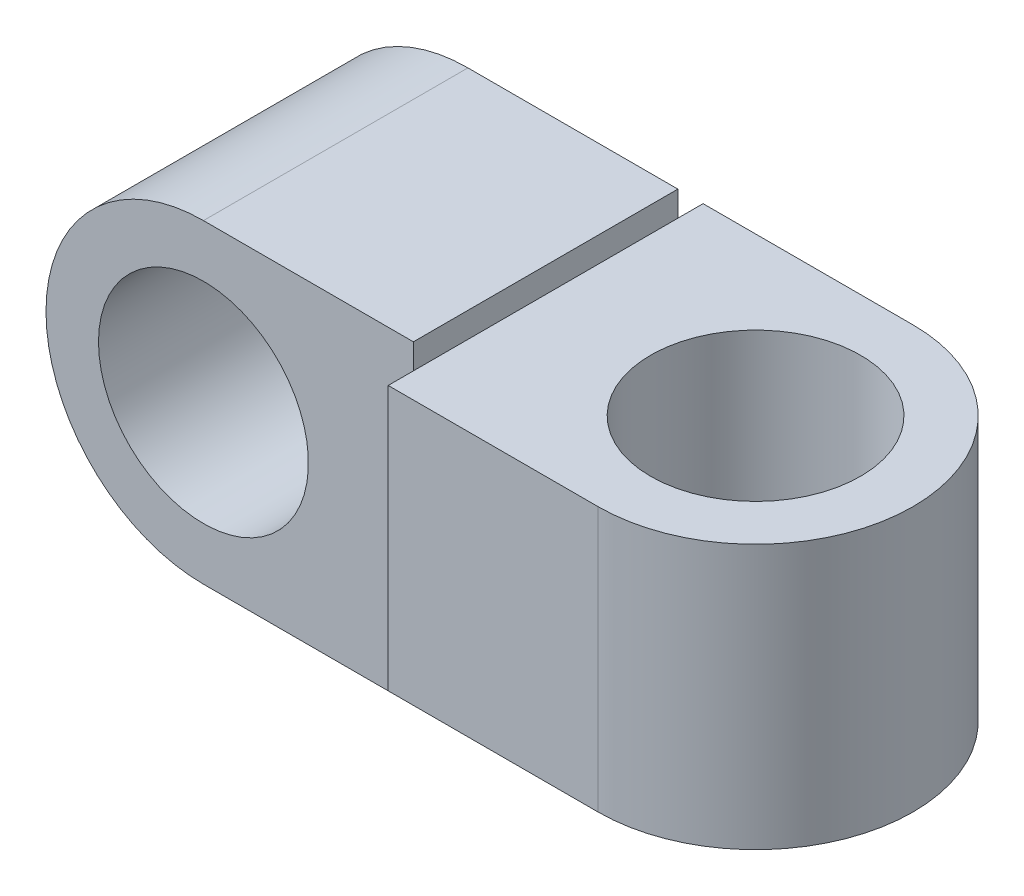
ISO-10303-21;
HEADER;
FILE_DESCRIPTION(('STEP AP214'),'2;1');
FILE_NAME('part.step','',(''),(''),'','','');
FILE_SCHEMA(('AUTOMOTIVE_DESIGN { 1 0 10303 214 1 1 1 1 }'));
ENDSEC;
DATA;
#1=APPLICATION_CONTEXT('core data for automotive mechanical design processes');
#2=APPLICATION_PROTOCOL_DEFINITION('international standard','automotive_design',2000,#1);
#3=PRODUCT_CONTEXT('',#1,'mechanical');
#4=PRODUCT('Part','Part','',(#3));
#5=PRODUCT_RELATED_PRODUCT_CATEGORY('part','',(#4));
#6=PRODUCT_DEFINITION_FORMATION('','',#4);
#7=PRODUCT_DEFINITION_CONTEXT('part definition',#1,'design');
#8=PRODUCT_DEFINITION('design','',#6,#7);
#9=PRODUCT_DEFINITION_SHAPE('','',#8);
#10=(LENGTH_UNIT() NAMED_UNIT(*) SI_UNIT(.MILLI.,.METRE.));
#11=(NAMED_UNIT(*) PLANE_ANGLE_UNIT() SI_UNIT($,.RADIAN.));
#12=(NAMED_UNIT(*) SI_UNIT($,.STERADIAN.) SOLID_ANGLE_UNIT());
#13=UNCERTAINTY_MEASURE_WITH_UNIT(LENGTH_MEASURE(1.E-05),#10,'distance_accuracy_value','');
#14=(GEOMETRIC_REPRESENTATION_CONTEXT(3) GLOBAL_UNCERTAINTY_ASSIGNED_CONTEXT((#13)) GLOBAL_UNIT_ASSIGNED_CONTEXT((#10,
#11,#12)) REPRESENTATION_CONTEXT('',''));
#15=CARTESIAN_POINT('',(0.,0.,0.));
#16=DIRECTION('',(0.,0.,1.));
#17=DIRECTION('',(1.,0.,0.));
#18=AXIS2_PLACEMENT_3D('',#15,#16,#17);
#19=CARTESIAN_POINT('',(0.,0.,9.99999999999987));
#20=DIRECTION('',(1.,0.,0.));
#21=DIRECTION('',(0.,0.,-0.999999999999996));
#22=AXIS2_PLACEMENT_3D('',#19,#20,#21);
#23=PLANE('',#22);
#24=DIRECTION('',(0.,-1.,0.));
#25=VECTOR('',#24,1.);
#26=CARTESIAN_POINT('',(0.,0.,9.99999999999987));
#27=LINE('',#26,#25);
#28=CARTESIAN_POINT('',(0.,11.90625,9.99999999999987));
#29=VERTEX_POINT('',#28);
#30=CARTESIAN_POINT('',(0.,10.,9.99999999999987));
#31=VERTEX_POINT('',#30);
#32=EDGE_CURVE('E181',#29,#31,#27,.T.);
#33=ORIENTED_EDGE('',*,*,#32,.T.);
#34=DIRECTION('',(0.,0.,-0.999999999999996));
#35=VECTOR('',#34,1.);
#36=CARTESIAN_POINT('',(0.,10.,0.));
#37=LINE('',#36,#35);
#38=CARTESIAN_POINT('',(0.,10.,-10.));
#39=VERTEX_POINT('',#38);
#40=EDGE_CURVE('E45',#31,#39,#37,.T.);
#41=ORIENTED_EDGE('',*,*,#40,.T.);
#42=DIRECTION('',(0.,-1.,0.));
#43=VECTOR('',#42,1.);
#44=CARTESIAN_POINT('',(0.,0.,-10.));
#45=LINE('',#44,#43);
#46=CARTESIAN_POINT('',(0.,11.90625,-10.));
#47=VERTEX_POINT('',#46);
#48=EDGE_CURVE('E195',#47,#39,#45,.T.);
#49=ORIENTED_EDGE('',*,*,#48,.F.);
#50=DIRECTION('',(0.,0.,-0.999999999999996));
#51=VECTOR('',#50,1.);
#52=CARTESIAN_POINT('',(0.,11.90625,9.99999999999987));
#53=LINE('',#52,#51);
#54=EDGE_CURVE('E202',#29,#47,#53,.T.);
#55=ORIENTED_EDGE('',*,*,#54,.F.);
#56=EDGE_LOOP('',(#33,#41,#49,#55));
#57=FACE_BOUND('',#56,.T.);
#58=ADVANCED_FACE('F36',(#57),#23,.T.);
#59=CARTESIAN_POINT('',(-15.875,0.,9.99999999999987));
#60=DIRECTION('',(0.,0.,-0.999999999999996));
#61=DIRECTION('',(-1.,0.,0.));
#62=AXIS2_PLACEMENT_3D('',#59,#60,#61);
#63=CYLINDRICAL_SURFACE('',#62,11.90625);
#64=CARTESIAN_POINT('',(-15.875,0.,-10.));
#65=DIRECTION('',(0.,0.,0.999999999999996));
#66=DIRECTION('',(1.,0.,0.));
#67=AXIS2_PLACEMENT_3D('',#64,#65,#66);
#68=CIRCLE('',#67,11.90625);
#69=CARTESIAN_POINT('',(-15.875,11.90625,-10.));
#70=VERTEX_POINT('',#69);
#71=CARTESIAN_POINT('',(-15.875,-11.90625,-10.));
#72=VERTEX_POINT('',#71);
#73=EDGE_CURVE('E189',#70,#72,#68,.T.);
#74=ORIENTED_EDGE('',*,*,#73,.T.);
#75=DIRECTION('',(0.,0.,-0.999999999999996));
#76=VECTOR('',#75,1.);
#77=CARTESIAN_POINT('',(-15.875,-11.90625,9.99999999999987));
#78=LINE('',#77,#76);
#79=CARTESIAN_POINT('',(-15.875,-11.90625,9.99999999999987));
#80=VERTEX_POINT('',#79);
#81=EDGE_CURVE('E40',#80,#72,#78,.T.);
#82=ORIENTED_EDGE('',*,*,#81,.F.);
#83=CARTESIAN_POINT('',(-15.875,0.,9.99999999999987));
#84=DIRECTION('',(0.,0.,0.999999999999996));
#85=DIRECTION('',(1.,0.,0.));
#86=AXIS2_PLACEMENT_3D('',#83,#84,#85);
#87=CIRCLE('',#86,11.90625);
#88=CARTESIAN_POINT('',(-15.875,11.90625,9.99999999999987));
#89=VERTEX_POINT('',#88);
#90=EDGE_CURVE('E90',#89,#80,#87,.T.);
#91=ORIENTED_EDGE('',*,*,#90,.F.);
#92=DIRECTION('',(0.,0.,-0.999999999999996));
#93=VECTOR('',#92,1.);
#94=CARTESIAN_POINT('',(-15.875,11.90625,9.99999999999987));
#95=LINE('',#94,#93);
#96=EDGE_CURVE('E64',#89,#70,#95,.T.);
#97=ORIENTED_EDGE('',*,*,#96,.T.);
#98=EDGE_LOOP('',(#74,#82,#91,#97));
#99=FACE_BOUND('',#98,.T.);
#100=ADVANCED_FACE('F227',(#99),#63,.T.);
#101=CARTESIAN_POINT('',(0.,-11.90625,9.99999999999987));
#102=DIRECTION('',(0.,-1.,0.));
#103=DIRECTION('',(0.,0.,-0.999999999999996));
#104=AXIS2_PLACEMENT_3D('',#101,#102,#103);
#105=PLANE('',#104);
#106=DIRECTION('',(-1.,0.,0.));
#107=VECTOR('',#106,1.);
#108=CARTESIAN_POINT('',(0.,-11.90625,-10.));
#109=LINE('',#108,#107);
#110=CARTESIAN_POINT('',(0.,-11.90625,-10.));
#111=VERTEX_POINT('',#110);
#112=EDGE_CURVE('E191',#111,#72,#109,.T.);
#113=ORIENTED_EDGE('',*,*,#112,.F.);
#114=DIRECTION('',(0.,0.,-0.999999999999996));
#115=VECTOR('',#114,1.);
#116=CARTESIAN_POINT('',(0.,-11.90625,9.99999999999987));
#117=LINE('',#116,#115);
#118=CARTESIAN_POINT('',(0.,-11.90625,9.99999999999987));
#119=VERTEX_POINT('',#118);
#120=EDGE_CURVE('E203',#119,#111,#117,.T.);
#121=ORIENTED_EDGE('',*,*,#120,.F.);
#122=DIRECTION('',(-1.,0.,0.));
#123=VECTOR('',#122,1.);
#124=CARTESIAN_POINT('',(0.,-11.90625,9.99999999999987));
#125=LINE('',#124,#123);
#126=EDGE_CURVE('E177',#119,#80,#125,.T.);
#127=ORIENTED_EDGE('',*,*,#126,.T.);
#128=ORIENTED_EDGE('',*,*,#81,.T.);
#129=EDGE_LOOP('',(#113,#121,#127,#128));
#130=FACE_BOUND('',#129,.T.);
#131=ADVANCED_FACE('F225',(#130),#105,.T.);
#132=DIRECTION('',(0.,0.,-0.999999999999996));
#133=VECTOR('',#132,1.);
#134=CARTESIAN_POINT('',(0.,-10.,0.));
#135=LINE('',#134,#133);
#136=CARTESIAN_POINT('',(0.,-10.,9.99999999999987));
#137=VERTEX_POINT('',#136);
#138=CARTESIAN_POINT('',(0.,-10.,-10.));
#139=VERTEX_POINT('',#138);
#140=EDGE_CURVE('E11',#137,#139,#135,.T.);
#141=ORIENTED_EDGE('',*,*,#140,.F.);
#142=EDGE_CURVE('E180',#137,#119,#27,.T.);
#143=ORIENTED_EDGE('',*,*,#142,.T.);
#144=ORIENTED_EDGE('',*,*,#120,.T.);
#145=EDGE_CURVE('E194',#139,#111,#45,.T.);
#146=ORIENTED_EDGE('',*,*,#145,.F.);
#147=EDGE_LOOP('',(#141,#143,#144,#146));
#148=FACE_BOUND('',#147,.T.);
#149=ADVANCED_FACE('F224',(#148),#23,.T.);
#150=CARTESIAN_POINT('',(-15.875,0.,9.99999999999987));
#151=DIRECTION('',(0.,0.,-0.999999999999996));
#152=DIRECTION('',(-1.,0.,0.));
#153=AXIS2_PLACEMENT_3D('',#150,#151,#152);
#154=CYLINDRICAL_SURFACE('',#153,7.9375);
#155=CARTESIAN_POINT('',(-15.875,0.,9.99999999999987));
#156=DIRECTION('',(0.,0.,0.999999999999996));
#157=DIRECTION('',(1.,0.,0.));
#158=AXIS2_PLACEMENT_3D('',#155,#156,#157);
#159=CIRCLE('',#158,7.9375);
#160=CARTESIAN_POINT('',(-23.8125,0.,9.99999999999987));
#161=VERTEX_POINT('',#160);
#162=EDGE_CURVE('E172',#161,#161,#159,.T.);
#163=CARTESIAN_POINT('',(-15.875,0.,-10.));
#164=DIRECTION('',(0.,0.,0.999999999999996));
#165=DIRECTION('',(1.,0.,0.));
#166=AXIS2_PLACEMENT_3D('',#163,#164,#165);
#167=CIRCLE('',#166,7.9375);
#168=CARTESIAN_POINT('',(-23.8125,0.,-10.));
#169=VERTEX_POINT('',#168);
#170=EDGE_CURVE('E144',#169,#169,#167,.T.);
#171=CARTESIAN_POINT('',(-23.8125,0.,9.99999999999987));
#172=CARTESIAN_POINT('',(-23.8125,0.,9.79166666666654));
#173=CARTESIAN_POINT('',(-23.8125,0.,9.5833333333332));
#174=CARTESIAN_POINT('',(-23.8125,0.,9.16666666666654));
#175=CARTESIAN_POINT('',(-23.8125,0.,8.95833333333321));
#176=CARTESIAN_POINT('',(-23.8125,0.,8.54166666666655));
#177=CARTESIAN_POINT('',(-23.8125,0.,8.33333333333321));
#178=CARTESIAN_POINT('',(-23.8125,0.,7.91666666666655));
#179=CARTESIAN_POINT('',(-23.8125,0.,7.70833333333322));
#180=CARTESIAN_POINT('',(-23.8125,0.,7.29166666666655));
#181=CARTESIAN_POINT('',(-23.8125,0.,7.08333333333322));
#182=CARTESIAN_POINT('',(-23.8125,0.,6.66666666666656));
#183=CARTESIAN_POINT('',(-23.8125,0.,6.45833333333322));
#184=CARTESIAN_POINT('',(-23.8125,0.,6.04166666666656));
#185=CARTESIAN_POINT('',(-23.8125,0.,5.83333333333323));
#186=CARTESIAN_POINT('',(-23.8125,0.,5.41666666666656));
#187=CARTESIAN_POINT('',(-23.8125,0.,5.20833333333323));
#188=CARTESIAN_POINT('',(-23.8125,0.,4.79166666666657));
#189=CARTESIAN_POINT('',(-23.8125,0.,4.58333333333323));
#190=CARTESIAN_POINT('',(-23.8125,0.,4.16666666666657));
#191=CARTESIAN_POINT('',(-23.8125,0.,3.95833333333324));
#192=CARTESIAN_POINT('',(-23.8125,0.,3.54166666666657));
#193=CARTESIAN_POINT('',(-23.8125,0.,3.33333333333324));
#194=CARTESIAN_POINT('',(-23.8125,0.,2.91666666666658));
#195=CARTESIAN_POINT('',(-23.8125,0.,2.70833333333325));
#196=CARTESIAN_POINT('',(-23.8125,0.,2.29166666666658));
#197=CARTESIAN_POINT('',(-23.8125,0.,2.08333333333325));
#198=CARTESIAN_POINT('',(-23.8125,0.,1.66666666666658));
#199=CARTESIAN_POINT('',(-23.8125,0.,1.45833333333325));
#200=CARTESIAN_POINT('',(-23.8125,0.,1.04166666666659));
#201=CARTESIAN_POINT('',(-23.8125,0.,0.833333333333256));
#202=CARTESIAN_POINT('',(-23.8125,0.,0.416666666666592));
#203=CARTESIAN_POINT('',(-23.8125,0.,0.208333333333259));
#204=CARTESIAN_POINT('',(-23.8125,0.,-0.208333333333405));
#205=CARTESIAN_POINT('',(-23.8125,0.,-0.416666666666738));
#206=CARTESIAN_POINT('',(-23.8125,0.,-0.833333333333402));
#207=CARTESIAN_POINT('',(-23.8125,0.,-1.04166666666673));
#208=CARTESIAN_POINT('',(-23.8125,0.,-1.4583333333334));
#209=CARTESIAN_POINT('',(-23.8125,0.,-1.66666666666673));
#210=CARTESIAN_POINT('',(-23.8125,0.,-2.08333333333339));
#211=CARTESIAN_POINT('',(-23.8125,0.,-2.29166666666673));
#212=CARTESIAN_POINT('',(-23.8125,0.,-2.70833333333339));
#213=CARTESIAN_POINT('',(-23.8125,0.,-2.91666666666672));
#214=CARTESIAN_POINT('',(-23.8125,0.,-3.33333333333339));
#215=CARTESIAN_POINT('',(-23.8125,0.,-3.54166666666672));
#216=CARTESIAN_POINT('',(-23.8125,0.,-3.95833333333338));
#217=CARTESIAN_POINT('',(-23.8125,0.,-4.16666666666671));
#218=CARTESIAN_POINT('',(-23.8125,0.,-4.58333333333338));
#219=CARTESIAN_POINT('',(-23.8125,0.,-4.79166666666671));
#220=CARTESIAN_POINT('',(-23.8125,0.,-5.20833333333337));
#221=CARTESIAN_POINT('',(-23.8125,0.,-5.41666666666671));
#222=CARTESIAN_POINT('',(-23.8125,0.,-5.83333333333337));
#223=CARTESIAN_POINT('',(-23.8125,0.,-6.0416666666667));
#224=CARTESIAN_POINT('',(-23.8125,0.,-6.45833333333337));
#225=CARTESIAN_POINT('',(-23.8125,0.,-6.6666666666667));
#226=CARTESIAN_POINT('',(-23.8125,0.,-7.08333333333336));
#227=CARTESIAN_POINT('',(-23.8125,0.,-7.2916666666667));
#228=CARTESIAN_POINT('',(-23.8125,0.,-7.70833333333336));
#229=CARTESIAN_POINT('',(-23.8125,0.,-7.91666666666669));
#230=CARTESIAN_POINT('',(-23.8125,0.,-8.33333333333336));
#231=CARTESIAN_POINT('',(-23.8125,0.,-8.54166666666669));
#232=CARTESIAN_POINT('',(-23.8125,0.,-8.95833333333335));
#233=CARTESIAN_POINT('',(-23.8125,0.,-9.16666666666668));
#234=CARTESIAN_POINT('',(-23.8125,0.,-9.58333333333335));
#235=CARTESIAN_POINT('',(-23.8125,0.,-9.79166666666668));
#236=CARTESIAN_POINT('',(-23.8125,0.,-10.));
#237=B_SPLINE_CURVE_WITH_KNOTS('',3,(#171,#172,#173,#174,#175,#176,#177,#178,#179,#180,#181,
#182,#183,#184,#185,#186,#187,#188,#189,#190,#191,#192,#193,#194,#195,#196,#197,#198,#199,#200,
#201,#202,#203,#204,#205,#206,#207,#208,#209,#210,#211,#212,#213,#214,#215,#216,#217,#218,#219,
#220,#221,#222,#223,#224,#225,#226,#227,#228,#229,#230,#231,#232,#233,#234,#235,#236),
.UNSPECIFIED.,.F.,.F.,(4,2,2,2,2,2,2,2,2,2,2,2,2,2,2,2,2,2,2,2,2,2,2,2,2,2,2,2,2,2,2,2,4),(0.,
0.624999999999995,1.24999999999999,1.87499999999999,2.49999999999998,3.12499999999998,
3.74999999999998,4.37499999999997,4.99999999999997,5.62499999999997,6.24999999999996,
6.87499999999996,7.49999999999995,8.12499999999995,8.74999999999995,9.37499999999994,
9.99999999999994,10.6249999999999,11.2499999999999,11.8749999999999,12.4999999999999,
13.1249999999999,13.7499999999999,14.3749999999999,14.9999999999999,15.6249999999999,
16.2499999999999,16.8749999999999,17.4999999999999,18.1249999999999,18.7499999999999,
19.3749999999999,19.9999999999999),.UNSPECIFIED.);
#238=EDGE_CURVE('BSEAM38',#161,#169,#237,.T.);
#239=ORIENTED_EDGE('',*,*,#162,.T.);
#240=ORIENTED_EDGE('',*,*,#170,.F.);
#241=ORIENTED_EDGE('',*,*,#238,.T.);
#242=ORIENTED_EDGE('',*,*,#238,.F.);
#243=EDGE_LOOP('',(#239,#241,#240,#242));
#244=FACE_BOUND('',#243,.T.);
#245=ADVANCED_FACE('F38',(#244),#154,.F.);
#246=CARTESIAN_POINT('',(0.,11.90625,9.99999999999987));
#247=DIRECTION('',(0.,1.,0.));
#248=DIRECTION('',(0.,0.,0.999999999999996));
#249=AXIS2_PLACEMENT_3D('',#246,#247,#248);
#250=PLANE('',#249);
#251=DIRECTION('',(1.,0.,0.));
#252=VECTOR('',#251,1.);
#253=CARTESIAN_POINT('',(0.,11.90625,-10.));
#254=LINE('',#253,#252);
#255=EDGE_CURVE('E175',#70,#47,#254,.T.);
#256=ORIENTED_EDGE('',*,*,#255,.F.);
#257=ORIENTED_EDGE('',*,*,#96,.F.);
#258=DIRECTION('',(1.,0.,0.));
#259=VECTOR('',#258,1.);
#260=CARTESIAN_POINT('',(0.,11.90625,9.99999999999987));
#261=LINE('',#260,#259);
#262=EDGE_CURVE('E184',#89,#29,#261,.T.);
#263=ORIENTED_EDGE('',*,*,#262,.T.);
#264=ORIENTED_EDGE('',*,*,#54,.T.);
#265=EDGE_LOOP('',(#256,#257,#263,#264));
#266=FACE_BOUND('',#265,.T.);
#267=ADVANCED_FACE('F217',(#266),#250,.T.);
#268=CARTESIAN_POINT('',(0.,0.,9.99999999999987));
#269=DIRECTION('',(0.,0.,0.999999999999996));
#270=DIRECTION('',(1.,0.,0.));
#271=AXIS2_PLACEMENT_3D('',#268,#269,#270);
#272=PLANE('',#271);
#273=ORIENTED_EDGE('',*,*,#162,.F.);
#274=EDGE_LOOP('',(#273));
#275=FACE_BOUND('',#274,.T.);
#276=ORIENTED_EDGE('',*,*,#90,.T.);
#277=ORIENTED_EDGE('',*,*,#126,.F.);
#278=ORIENTED_EDGE('',*,*,#142,.F.);
#279=EDGE_CURVE('E185',#31,#137,#27,.T.);
#280=ORIENTED_EDGE('',*,*,#279,.F.);
#281=ORIENTED_EDGE('',*,*,#32,.F.);
#282=ORIENTED_EDGE('',*,*,#262,.F.);
#283=EDGE_LOOP('',(#276,#277,#278,#280,#281,#282));
#284=FACE_BOUND('',#283,.T.);
#285=ADVANCED_FACE('F219',(#275,#284),#272,.T.);
#286=CARTESIAN_POINT('',(0.,0.,-10.));
#287=DIRECTION('',(0.,0.,0.999999999999996));
#288=DIRECTION('',(1.,0.,0.));
#289=AXIS2_PLACEMENT_3D('',#286,#287,#288);
#290=PLANE('',#289);
#291=ORIENTED_EDGE('',*,*,#170,.T.);
#292=EDGE_LOOP('',(#291));
#293=FACE_BOUND('',#292,.T.);
#294=ORIENTED_EDGE('',*,*,#73,.F.);
#295=ORIENTED_EDGE('',*,*,#255,.T.);
#296=ORIENTED_EDGE('',*,*,#48,.T.);
#297=EDGE_CURVE('E198',#39,#139,#45,.T.);
#298=ORIENTED_EDGE('',*,*,#297,.T.);
#299=ORIENTED_EDGE('',*,*,#145,.T.);
#300=ORIENTED_EDGE('',*,*,#112,.T.);
#301=EDGE_LOOP('',(#294,#295,#296,#298,#299,#300));
#302=FACE_BOUND('',#301,.T.);
#303=ADVANCED_FACE('F216',(#293,#302),#290,.F.);
#304=CARTESIAN_POINT('',(0.,10.,0.));
#305=DIRECTION('',(-1.,0.,0.));
#306=DIRECTION('',(0.,0.,0.999999999999996));
#307=AXIS2_PLACEMENT_3D('',#304,#305,#306);
#308=PLANE('',#307);
#309=ORIENTED_EDGE('',*,*,#297,.F.);
#310=CARTESIAN_POINT('',(0.,10.,-11.90625));
#311=VERTEX_POINT('',#310);
#312=EDGE_CURVE('E55',#39,#311,#37,.T.);
#313=ORIENTED_EDGE('',*,*,#312,.T.);
#314=DIRECTION('',(0.,-1.,0.));
#315=VECTOR('',#314,1.);
#316=CARTESIAN_POINT('',(0.,10.,-11.90625));
#317=LINE('',#316,#315);
#318=CARTESIAN_POINT('',(0.,-10.,-11.90625));
#319=VERTEX_POINT('',#318);
#320=EDGE_CURVE('E145',#311,#319,#317,.T.);
#321=ORIENTED_EDGE('',*,*,#320,.T.);
#322=EDGE_CURVE('E48',#139,#319,#135,.T.);
#323=ORIENTED_EDGE('',*,*,#322,.F.);
#324=EDGE_LOOP('',(#309,#313,#321,#323));
#325=FACE_BOUND('',#324,.T.);
#326=ADVANCED_FACE('F242',(#325),#308,.T.);
#327=CARTESIAN_POINT('',(15.875,10.,0.));
#328=DIRECTION('',(0.,-1.,0.));
#329=DIRECTION('',(0.,0.,-0.999999999999996));
#330=AXIS2_PLACEMENT_3D('',#327,#328,#329);
#331=CYLINDRICAL_SURFACE('',#330,11.90625);
#332=CARTESIAN_POINT('',(15.875,-10.,0.));
#333=DIRECTION('',(0.,1.,0.));
#334=DIRECTION('',(0.,0.,0.999999999999996));
#335=AXIS2_PLACEMENT_3D('',#332,#333,#334);
#336=CIRCLE('',#335,11.90625);
#337=CARTESIAN_POINT('',(15.875,-10.,11.9062499999999));
#338=VERTEX_POINT('',#337);
#339=CARTESIAN_POINT('',(15.875,-10.,-11.90625));
#340=VERTEX_POINT('',#339);
#341=EDGE_CURVE('E140',#338,#340,#336,.T.);
#342=ORIENTED_EDGE('',*,*,#341,.T.);
#343=DIRECTION('',(0.,-1.,0.));
#344=VECTOR('',#343,1.);
#345=CARTESIAN_POINT('',(15.875,10.,-11.90625));
#346=LINE('',#345,#344);
#347=CARTESIAN_POINT('',(15.875,10.,-11.90625));
#348=VERTEX_POINT('',#347);
#349=EDGE_CURVE('E137',#348,#340,#346,.T.);
#350=ORIENTED_EDGE('',*,*,#349,.F.);
#351=CARTESIAN_POINT('',(15.875,10.,0.));
#352=DIRECTION('',(0.,1.,0.));
#353=DIRECTION('',(0.,0.,0.999999999999996));
#354=AXIS2_PLACEMENT_3D('',#351,#352,#353);
#355=CIRCLE('',#354,11.90625);
#356=CARTESIAN_POINT('',(15.875,10.,11.9062499999999));
#357=VERTEX_POINT('',#356);
#358=EDGE_CURVE('E125',#357,#348,#355,.T.);
#359=ORIENTED_EDGE('',*,*,#358,.F.);
#360=DIRECTION('',(0.,-1.,0.));
#361=VECTOR('',#360,1.);
#362=CARTESIAN_POINT('',(15.875,10.,11.9062499999999));
#363=LINE('',#362,#361);
#364=EDGE_CURVE('E157',#357,#338,#363,.T.);
#365=ORIENTED_EDGE('',*,*,#364,.T.);
#366=EDGE_LOOP('',(#342,#350,#359,#365));
#367=FACE_BOUND('',#366,.T.);
#368=ADVANCED_FACE('F138',(#367),#331,.T.);
#369=CARTESIAN_POINT('',(0.,10.,-11.90625));
#370=DIRECTION('',(0.,0.,-0.999999999999996));
#371=DIRECTION('',(-1.,0.,0.));
#372=AXIS2_PLACEMENT_3D('',#369,#370,#371);
#373=PLANE('',#372);
#374=DIRECTION('',(1.,0.,0.));
#375=VECTOR('',#374,1.);
#376=CARTESIAN_POINT('',(0.,-10.,-11.90625));
#377=LINE('',#376,#375);
#378=EDGE_CURVE('E162',#319,#340,#377,.T.);
#379=ORIENTED_EDGE('',*,*,#378,.F.);
#380=ORIENTED_EDGE('',*,*,#320,.F.);
#381=DIRECTION('',(1.,0.,0.));
#382=VECTOR('',#381,1.);
#383=CARTESIAN_POINT('',(0.,10.,-11.90625));
#384=LINE('',#383,#382);
#385=EDGE_CURVE('E129',#311,#348,#384,.T.);
#386=ORIENTED_EDGE('',*,*,#385,.T.);
#387=ORIENTED_EDGE('',*,*,#349,.T.);
#388=EDGE_LOOP('',(#379,#380,#386,#387));
#389=FACE_BOUND('',#388,.T.);
#390=ADVANCED_FACE('F148',(#389),#373,.T.);
#391=CARTESIAN_POINT('',(0.,10.,11.9062499999999));
#392=VERTEX_POINT('',#391);
#393=EDGE_CURVE('E151',#392,#31,#37,.T.);
#394=ORIENTED_EDGE('',*,*,#393,.T.);
#395=ORIENTED_EDGE('',*,*,#279,.T.);
#396=CARTESIAN_POINT('',(0.,-10.,11.9062499999999));
#397=VERTEX_POINT('',#396);
#398=EDGE_CURVE('E47',#397,#137,#135,.T.);
#399=ORIENTED_EDGE('',*,*,#398,.F.);
#400=DIRECTION('',(0.,-1.,0.));
#401=VECTOR('',#400,1.);
#402=CARTESIAN_POINT('',(0.,10.,11.9062499999999));
#403=LINE('',#402,#401);
#404=EDGE_CURVE('E169',#392,#397,#403,.T.);
#405=ORIENTED_EDGE('',*,*,#404,.F.);
#406=EDGE_LOOP('',(#394,#395,#399,#405));
#407=FACE_BOUND('',#406,.T.);
#408=ADVANCED_FACE('F251',(#407),#308,.T.);
#409=CARTESIAN_POINT('',(15.875,10.,0.));
#410=DIRECTION('',(0.,-1.,0.));
#411=DIRECTION('',(0.,0.,-0.999999999999996));
#412=AXIS2_PLACEMENT_3D('',#409,#410,#411);
#413=CYLINDRICAL_SURFACE('',#412,7.9375);
#414=CARTESIAN_POINT('',(15.875,10.,0.));
#415=DIRECTION('',(0.,1.,0.));
#416=DIRECTION('',(0.,0.,0.999999999999996));
#417=AXIS2_PLACEMENT_3D('',#414,#415,#416);
#418=CIRCLE('',#417,7.9375);
#419=CARTESIAN_POINT('',(15.875,10.,7.93749999999997));
#420=VERTEX_POINT('',#419);
#421=EDGE_CURVE('E134',#420,#420,#418,.T.);
#422=ORIENTED_EDGE('',*,*,#421,.T.);
#423=EDGE_LOOP('',(#422));
#424=FACE_BOUND('',#423,.T.);
#425=CARTESIAN_POINT('',(15.875,-10.,0.));
#426=DIRECTION('',(0.,1.,0.));
#427=DIRECTION('',(0.,0.,0.999999999999996));
#428=AXIS2_PLACEMENT_3D('',#425,#426,#427);
#429=CIRCLE('',#428,7.9375);
#430=CARTESIAN_POINT('',(15.875,-10.,7.93749999999997));
#431=VERTEX_POINT('',#430);
#432=EDGE_CURVE('E158',#431,#431,#429,.T.);
#433=ORIENTED_EDGE('',*,*,#432,.F.);
#434=EDGE_LOOP('',(#433));
#435=FACE_BOUND('',#434,.T.);
#436=ADVANCED_FACE('F247',(#424,#435),#413,.F.);
#437=CARTESIAN_POINT('',(0.,10.,11.9062499999999));
#438=DIRECTION('',(0.,0.,0.999999999999996));
#439=DIRECTION('',(1.,0.,0.));
#440=AXIS2_PLACEMENT_3D('',#437,#438,#439);
#441=PLANE('',#440);
#442=DIRECTION('',(-1.,0.,0.));
#443=VECTOR('',#442,1.);
#444=CARTESIAN_POINT('',(0.,-10.,11.9062499999999));
#445=LINE('',#444,#443);
#446=EDGE_CURVE('E165',#338,#397,#445,.T.);
#447=ORIENTED_EDGE('',*,*,#446,.F.);
#448=ORIENTED_EDGE('',*,*,#364,.F.);
#449=DIRECTION('',(-1.,0.,0.));
#450=VECTOR('',#449,1.);
#451=CARTESIAN_POINT('',(0.,10.,11.9062499999999));
#452=LINE('',#451,#450);
#453=EDGE_CURVE('E132',#357,#392,#452,.T.);
#454=ORIENTED_EDGE('',*,*,#453,.T.);
#455=ORIENTED_EDGE('',*,*,#404,.T.);
#456=EDGE_LOOP('',(#447,#448,#454,#455));
#457=FACE_BOUND('',#456,.T.);
#458=ADVANCED_FACE('F250',(#457),#441,.T.);
#459=CARTESIAN_POINT('',(0.,10.,0.));
#460=DIRECTION('',(0.,1.,0.));
#461=DIRECTION('',(0.,0.,0.999999999999996));
#462=AXIS2_PLACEMENT_3D('',#459,#460,#461);
#463=PLANE('',#462);
#464=ORIENTED_EDGE('',*,*,#421,.F.);
#465=EDGE_LOOP('',(#464));
#466=FACE_BOUND('',#465,.T.);
#467=ORIENTED_EDGE('',*,*,#358,.T.);
#468=ORIENTED_EDGE('',*,*,#385,.F.);
#469=ORIENTED_EDGE('',*,*,#312,.F.);
#470=ORIENTED_EDGE('',*,*,#40,.F.);
#471=ORIENTED_EDGE('',*,*,#393,.F.);
#472=ORIENTED_EDGE('',*,*,#453,.F.);
#473=EDGE_LOOP('',(#467,#468,#469,#470,#471,#472));
#474=FACE_BOUND('',#473,.T.);
#475=ADVANCED_FACE('F127',(#466,#474),#463,.T.);
#476=CARTESIAN_POINT('',(0.,-10.,0.));
#477=DIRECTION('',(0.,1.,0.));
#478=DIRECTION('',(0.,0.,0.999999999999996));
#479=AXIS2_PLACEMENT_3D('',#476,#477,#478);
#480=PLANE('',#479);
#481=ORIENTED_EDGE('',*,*,#432,.T.);
#482=EDGE_LOOP('',(#481));
#483=FACE_BOUND('',#482,.T.);
#484=ORIENTED_EDGE('',*,*,#341,.F.);
#485=ORIENTED_EDGE('',*,*,#446,.T.);
#486=ORIENTED_EDGE('',*,*,#398,.T.);
#487=ORIENTED_EDGE('',*,*,#140,.T.);
#488=ORIENTED_EDGE('',*,*,#322,.T.);
#489=ORIENTED_EDGE('',*,*,#378,.T.);
#490=EDGE_LOOP('',(#484,#485,#486,#487,#488,#489));
#491=FACE_BOUND('',#490,.T.);
#492=ADVANCED_FACE('F262',(#483,#491),#480,.F.);
#493=CLOSED_SHELL('',(#58,#100,#131,#149,#245,#267,#285,#303,#326,#368,#390,#408,#436,#458,#475,#492));
#494=MANIFOLD_SOLID_BREP('B2',#493);
#495=ADVANCED_BREP_SHAPE_REPRESENTATION('',(#18,#494),#14);
#496=SHAPE_DEFINITION_REPRESENTATION(#9,#495);
ENDSEC;
END-ISO-10303-21;
